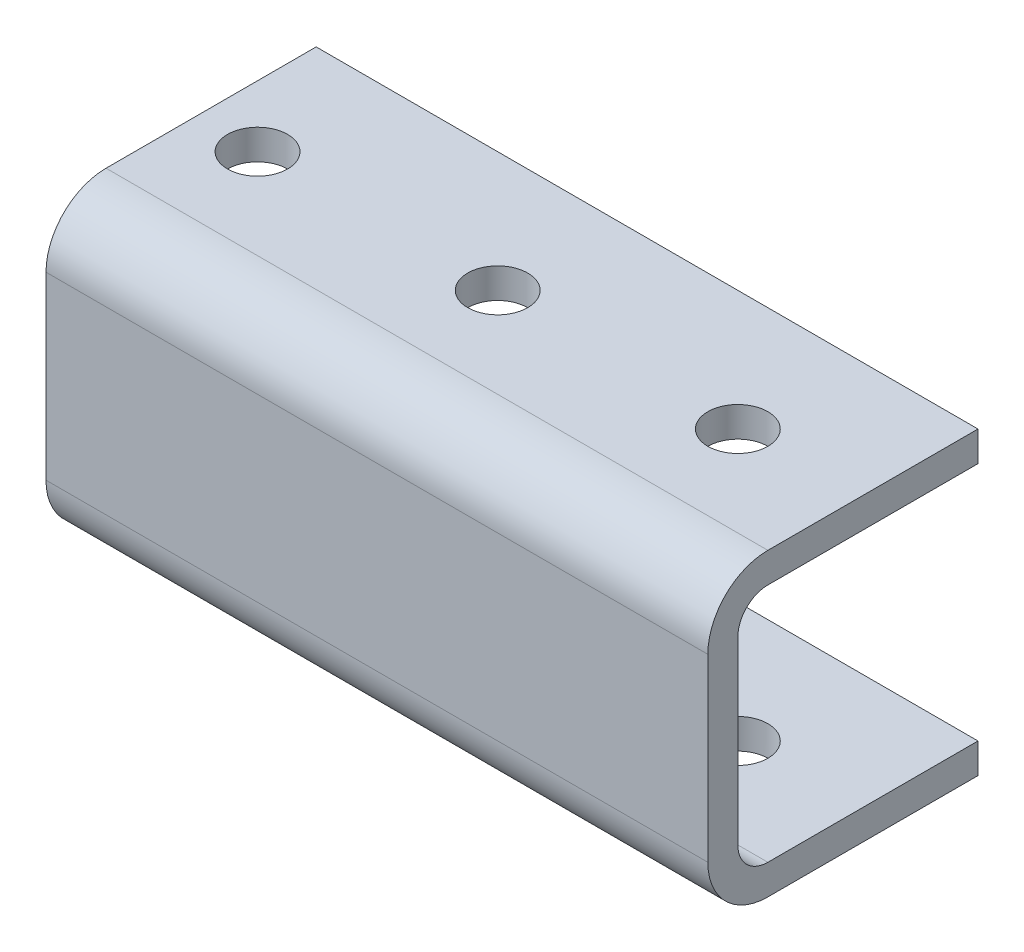
ISO-10303-21;
HEADER;
FILE_DESCRIPTION(('STEP AP214'),'2;1');
FILE_NAME('part.step','',(''),(''),'','','');
FILE_SCHEMA(('AUTOMOTIVE_DESIGN { 1 0 10303 214 1 1 1 1 }'));
ENDSEC;
DATA;
#1=APPLICATION_CONTEXT('core data for automotive mechanical design processes');
#2=APPLICATION_PROTOCOL_DEFINITION('international standard','automotive_design',2000,#1);
#3=PRODUCT_CONTEXT('',#1,'mechanical');
#4=PRODUCT('Part','Part','',(#3));
#5=PRODUCT_RELATED_PRODUCT_CATEGORY('part','',(#4));
#6=PRODUCT_DEFINITION_FORMATION('','',#4);
#7=PRODUCT_DEFINITION_CONTEXT('part definition',#1,'design');
#8=PRODUCT_DEFINITION('design','',#6,#7);
#9=PRODUCT_DEFINITION_SHAPE('','',#8);
#10=(LENGTH_UNIT() NAMED_UNIT(*) SI_UNIT(.MILLI.,.METRE.));
#11=(NAMED_UNIT(*) PLANE_ANGLE_UNIT() SI_UNIT($,.RADIAN.));
#12=(NAMED_UNIT(*) SI_UNIT($,.STERADIAN.) SOLID_ANGLE_UNIT());
#13=UNCERTAINTY_MEASURE_WITH_UNIT(LENGTH_MEASURE(1.E-05),#10,'distance_accuracy_value','');
#14=(GEOMETRIC_REPRESENTATION_CONTEXT(3) GLOBAL_UNCERTAINTY_ASSIGNED_CONTEXT((#13)) GLOBAL_UNIT_ASSIGNED_CONTEXT((#10,
#11,#12)) REPRESENTATION_CONTEXT('',''));
#15=CARTESIAN_POINT('',(0.,0.,0.));
#16=DIRECTION('',(0.,0.,1.));
#17=DIRECTION('',(1.,0.,0.));
#18=AXIS2_PLACEMENT_3D('',#15,#16,#17);
#19=CARTESIAN_POINT('',(872.981011996506,-4.02704283352276,-25.4));
#20=DIRECTION('',(0.,-1.,0.));
#21=DIRECTION('',(0.,0.,-1.));
#22=AXIS2_PLACEMENT_3D('',#19,#20,#21);
#23=PLANE('',#22);
#24=CARTESIAN_POINT('',(860.280011996506,-4.02704283352274,-12.7000000000001));
#25=DIRECTION('',(0.,1.,0.));
#26=DIRECTION('',(0.,0.,1.));
#27=AXIS2_PLACEMENT_3D('',#24,#25,#26);
#28=CIRCLE('',#27,3.17500000000001);
#29=CARTESIAN_POINT('',(860.280011996506,-4.02704283352273,-9.52500000000011));
#30=VERTEX_POINT('',#29);
#31=EDGE_CURVE('E187',#30,#30,#28,.T.);
#32=ORIENTED_EDGE('',*,*,#31,.F.);
#33=EDGE_LOOP('',(#32));
#34=FACE_BOUND('',#33,.T.);
#35=CARTESIAN_POINT('',(834.880011996506,-4.02704283352274,-12.7000000000001));
#36=DIRECTION('',(0.,1.,0.));
#37=DIRECTION('',(0.,0.,1.));
#38=AXIS2_PLACEMENT_3D('',#35,#36,#37);
#39=CIRCLE('',#38,3.17500000000001);
#40=CARTESIAN_POINT('',(834.880011996506,-4.02704283352273,-9.52500000000011));
#41=VERTEX_POINT('',#40);
#42=EDGE_CURVE('E181',#41,#41,#39,.T.);
#43=ORIENTED_EDGE('',*,*,#42,.F.);
#44=EDGE_LOOP('',(#43));
#45=FACE_BOUND('',#44,.T.);
#46=CARTESIAN_POINT('',(809.480011996506,-4.02704283352274,-12.7000000000001));
#47=DIRECTION('',(0.,1.,0.));
#48=DIRECTION('',(0.,0.,1.));
#49=AXIS2_PLACEMENT_3D('',#46,#47,#48);
#50=CIRCLE('',#49,3.17500000000001);
#51=CARTESIAN_POINT('',(809.480011996506,-4.02704283352273,-9.5250000000001));
#52=VERTEX_POINT('',#51);
#53=EDGE_CURVE('E175',#52,#52,#50,.T.);
#54=ORIENTED_EDGE('',*,*,#53,.F.);
#55=EDGE_LOOP('',(#54));
#56=FACE_BOUND('',#55,.T.);
#57=DIRECTION('',(-1.,0.,0.));
#58=VECTOR('',#57,1.);
#59=CARTESIAN_POINT('',(872.981011996506,-4.02704283352276,-25.4));
#60=LINE('',#59,#58);
#61=CARTESIAN_POINT('',(872.980011996506,-4.02704283352276,-25.4));
#62=VERTEX_POINT('',#61);
#63=CARTESIAN_POINT('',(802.980011996506,-4.02704283352282,-25.4));
#64=VERTEX_POINT('',#63);
#65=EDGE_CURVE('E155',#62,#64,#60,.T.);
#66=ORIENTED_EDGE('',*,*,#65,.T.);
#67=DIRECTION('',(0.,0.,1.));
#68=VECTOR('',#67,1.);
#69=CARTESIAN_POINT('',(802.980011996506,-4.02704283352276,-25.4));
#70=LINE('',#69,#68);
#71=CARTESIAN_POINT('',(802.980011996506,-4.02704283352272,-3.175));
#72=VERTEX_POINT('',#71);
#73=EDGE_CURVE('E307',#64,#72,#70,.T.);
#74=ORIENTED_EDGE('',*,*,#73,.T.);
#75=DIRECTION('',(-1.,0.,0.));
#76=VECTOR('',#75,1.);
#77=CARTESIAN_POINT('',(872.980011996506,-4.02704283352272,-3.17499999999999));
#78=LINE('',#77,#76);
#79=CARTESIAN_POINT('',(872.980011996506,-4.02704283352272,-3.17499999999999));
#80=VERTEX_POINT('',#79);
#81=EDGE_CURVE('E203',#72,#80,#78,.F.);
#82=ORIENTED_EDGE('',*,*,#81,.T.);
#83=DIRECTION('',(0.,0.,1.));
#84=VECTOR('',#83,1.);
#85=CARTESIAN_POINT('',(872.980011996506,-4.02704283352276,-25.4));
#86=LINE('',#85,#84);
#87=EDGE_CURVE('E305',#62,#80,#86,.T.);
#88=ORIENTED_EDGE('',*,*,#87,.F.);
#89=EDGE_LOOP('',(#66,#74,#82,#88));
#90=FACE_BOUND('',#89,.T.);
#91=ADVANCED_FACE('F34',(#34,#45,#56,#90),#23,.F.);
#92=CARTESIAN_POINT('',(872.980011996506,-7.20204283352271,-25.4));
#93=DIRECTION('',(0.,0.,1.));
#94=DIRECTION('',(1.,0.,0.));
#95=AXIS2_PLACEMENT_3D('',#92,#93,#94);
#96=PLANE('',#95);
#97=DIRECTION('',(-1.,0.,0.));
#98=VECTOR('',#97,1.);
#99=CARTESIAN_POINT('',(872.981011996506,21.3729571664772,-25.4));
#100=LINE('',#99,#98);
#101=CARTESIAN_POINT('',(872.980011996506,21.3729571664772,-25.4));
#102=VERTEX_POINT('',#101);
#103=CARTESIAN_POINT('',(802.980011996506,21.3729571664772,-25.4));
#104=VERTEX_POINT('',#103);
#105=EDGE_CURVE('E135',#102,#104,#100,.T.);
#106=ORIENTED_EDGE('',*,*,#105,.T.);
#107=DIRECTION('',(0.,1.,0.));
#108=VECTOR('',#107,1.);
#109=CARTESIAN_POINT('',(802.980011996506,-161.452042833523,-25.4));
#110=LINE('',#109,#108);
#111=CARTESIAN_POINT('',(802.980011996506,24.5479571664772,-25.4));
#112=VERTEX_POINT('',#111);
#113=EDGE_CURVE('E124',#104,#112,#110,.T.);
#114=ORIENTED_EDGE('',*,*,#113,.T.);
#115=DIRECTION('',(-1.,0.,0.));
#116=VECTOR('',#115,1.);
#117=CARTESIAN_POINT('',(872.980011996506,24.5479571664772,-25.4));
#118=LINE('',#117,#116);
#119=CARTESIAN_POINT('',(872.980011996506,24.5479571664772,-25.4));
#120=VERTEX_POINT('',#119);
#121=EDGE_CURVE('E133',#120,#112,#118,.T.);
#122=ORIENTED_EDGE('',*,*,#121,.F.);
#123=DIRECTION('',(0.,1.,0.));
#124=VECTOR('',#123,1.);
#125=CARTESIAN_POINT('',(872.980011996506,-7.20204283352271,-25.4));
#126=LINE('',#125,#124);
#127=EDGE_CURVE('E147',#102,#120,#126,.T.);
#128=ORIENTED_EDGE('',*,*,#127,.F.);
#129=EDGE_LOOP('',(#106,#114,#122,#128));
#130=FACE_BOUND('',#129,.T.);
#131=ADVANCED_FACE('F131',(#130),#96,.F.);
#132=CARTESIAN_POINT('',(-16.0199880034941,-7.20204283352271,-25.4));
#133=DIRECTION('',(0.,-1.,0.));
#134=DIRECTION('',(0.,0.,-1.));
#135=AXIS2_PLACEMENT_3D('',#132,#133,#134);
#136=PLANE('',#135);
#137=DIRECTION('',(0.,0.,1.));
#138=VECTOR('',#137,1.);
#139=CARTESIAN_POINT('',(802.980011996506,-7.20204283352271,-25.4));
#140=LINE('',#139,#138);
#141=CARTESIAN_POINT('',(802.980011996506,-7.20204283352283,-25.4));
#142=VERTEX_POINT('',#141);
#143=CARTESIAN_POINT('',(802.980011996506,-7.20204283352271,-3.175));
#144=VERTEX_POINT('',#143);
#145=EDGE_CURVE('E337',#142,#144,#140,.T.);
#146=ORIENTED_EDGE('',*,*,#145,.F.);
#147=DIRECTION('',(1.,0.,0.));
#148=VECTOR('',#147,1.);
#149=CARTESIAN_POINT('',(-16.0199880034941,-7.20204283352271,-25.4));
#150=LINE('',#149,#148);
#151=CARTESIAN_POINT('',(872.980011996506,-7.20204283352271,-25.4));
#152=VERTEX_POINT('',#151);
#153=EDGE_CURVE('E154',#142,#152,#150,.T.);
#154=ORIENTED_EDGE('',*,*,#153,.T.);
#155=DIRECTION('',(0.,0.,1.));
#156=VECTOR('',#155,1.);
#157=CARTESIAN_POINT('',(872.980011996506,-7.20204283352271,-25.4));
#158=LINE('',#157,#156);
#159=CARTESIAN_POINT('',(872.980011996506,-7.20204283352271,-3.175));
#160=VERTEX_POINT('',#159);
#161=EDGE_CURVE('E141',#152,#160,#158,.T.);
#162=ORIENTED_EDGE('',*,*,#161,.T.);
#163=DIRECTION('',(1.,0.,0.));
#164=VECTOR('',#163,1.);
#165=CARTESIAN_POINT('',(-16.0199880034941,-7.20204283352271,-3.175));
#166=LINE('',#165,#164);
#167=EDGE_CURVE('E211',#160,#144,#166,.F.);
#168=ORIENTED_EDGE('',*,*,#167,.T.);
#169=EDGE_LOOP('',(#146,#154,#162,#168));
#170=FACE_BOUND('',#169,.T.);
#171=CARTESIAN_POINT('',(860.280011996506,-7.20204283352271,-12.7000000000001));
#172=DIRECTION('',(0.,-1.,0.));
#173=DIRECTION('',(0.,0.,-1.));
#174=AXIS2_PLACEMENT_3D('',#171,#172,#173);
#175=CIRCLE('',#174,3.17500000000001);
#176=CARTESIAN_POINT('',(860.280011996506,-7.20204283352271,-15.8750000000001));
#177=VERTEX_POINT('',#176);
#178=EDGE_CURVE('E190',#177,#177,#175,.T.);
#179=ORIENTED_EDGE('',*,*,#178,.F.);
#180=EDGE_LOOP('',(#179));
#181=FACE_BOUND('',#180,.T.);
#182=CARTESIAN_POINT('',(834.880011996506,-7.20204283352271,-12.7000000000001));
#183=DIRECTION('',(0.,-1.,0.));
#184=DIRECTION('',(0.,0.,-1.));
#185=AXIS2_PLACEMENT_3D('',#182,#183,#184);
#186=CIRCLE('',#185,3.17500000000001);
#187=CARTESIAN_POINT('',(834.880011996506,-7.20204283352271,-15.8750000000001));
#188=VERTEX_POINT('',#187);
#189=EDGE_CURVE('E184',#188,#188,#186,.T.);
#190=ORIENTED_EDGE('',*,*,#189,.F.);
#191=EDGE_LOOP('',(#190));
#192=FACE_BOUND('',#191,.T.);
#193=CARTESIAN_POINT('',(809.480011996506,-7.20204283352271,-12.7000000000001));
#194=DIRECTION('',(0.,-1.,0.));
#195=DIRECTION('',(0.,0.,-1.));
#196=AXIS2_PLACEMENT_3D('',#193,#194,#195);
#197=CIRCLE('',#196,3.17500000000001);
#198=CARTESIAN_POINT('',(809.480011996506,-7.20204283352271,-15.8750000000001));
#199=VERTEX_POINT('',#198);
#200=EDGE_CURVE('E178',#199,#199,#197,.T.);
#201=ORIENTED_EDGE('',*,*,#200,.F.);
#202=EDGE_LOOP('',(#201));
#203=FACE_BOUND('',#202,.T.);
#204=ADVANCED_FACE('F245',(#170,#181,#192,#203),#136,.T.);
#205=CARTESIAN_POINT('',(872.980011996506,24.5479571664772,-25.4));
#206=DIRECTION('',(0.,1.,0.));
#207=DIRECTION('',(-1.,0.,0.));
#208=AXIS2_PLACEMENT_3D('',#205,#206,#207);
#209=PLANE('',#208);
#210=DIRECTION('',(0.,0.,-1.));
#211=VECTOR('',#210,1.);
#212=CARTESIAN_POINT('',(802.980011996506,24.5479571664772,-25.4));
#213=LINE('',#212,#211);
#214=CARTESIAN_POINT('',(802.980011996506,24.5479571664772,-3.17500000000001));
#215=VERTEX_POINT('',#214);
#216=EDGE_CURVE('E121',#215,#112,#213,.T.);
#217=ORIENTED_EDGE('',*,*,#216,.F.);
#218=DIRECTION('',(-1.,0.,0.));
#219=VECTOR('',#218,1.);
#220=CARTESIAN_POINT('',(872.980011996506,24.5479571664772,-3.175));
#221=LINE('',#220,#219);
#222=CARTESIAN_POINT('',(872.980011996506,24.5479571664772,-3.175));
#223=VERTEX_POINT('',#222);
#224=EDGE_CURVE('E56',#215,#223,#221,.F.);
#225=ORIENTED_EDGE('',*,*,#224,.T.);
#226=DIRECTION('',(0.,0.,1.));
#227=VECTOR('',#226,1.);
#228=CARTESIAN_POINT('',(872.980011996506,24.5479571664772,-25.4));
#229=LINE('',#228,#227);
#230=EDGE_CURVE('E140',#120,#223,#229,.T.);
#231=ORIENTED_EDGE('',*,*,#230,.F.);
#232=ORIENTED_EDGE('',*,*,#121,.T.);
#233=EDGE_LOOP('',(#217,#225,#231,#232));
#234=FACE_BOUND('',#233,.T.);
#235=CARTESIAN_POINT('',(860.280011996506,24.5479571664772,-12.7000000000001));
#236=DIRECTION('',(0.,1.,0.));
#237=DIRECTION('',(0.,0.,1.));
#238=AXIS2_PLACEMENT_3D('',#235,#236,#237);
#239=CIRCLE('',#238,3.17500000000001);
#240=CARTESIAN_POINT('',(860.280011996506,24.5479571664772,-9.52500000000005));
#241=VERTEX_POINT('',#240);
#242=EDGE_CURVE('E172',#241,#241,#239,.T.);
#243=ORIENTED_EDGE('',*,*,#242,.F.);
#244=EDGE_LOOP('',(#243));
#245=FACE_BOUND('',#244,.T.);
#246=CARTESIAN_POINT('',(834.880011996506,24.5479571664772,-12.7000000000001));
#247=DIRECTION('',(0.,1.,0.));
#248=DIRECTION('',(0.,0.,1.));
#249=AXIS2_PLACEMENT_3D('',#246,#247,#248);
#250=CIRCLE('',#249,3.17500000000001);
#251=CARTESIAN_POINT('',(834.880011996506,24.5479571664772,-9.52500000000005));
#252=VERTEX_POINT('',#251);
#253=EDGE_CURVE('E166',#252,#252,#250,.T.);
#254=ORIENTED_EDGE('',*,*,#253,.F.);
#255=EDGE_LOOP('',(#254));
#256=FACE_BOUND('',#255,.T.);
#257=CARTESIAN_POINT('',(809.480011996506,24.5479571664772,-12.7000000000001));
#258=DIRECTION('',(0.,1.,0.));
#259=DIRECTION('',(0.,0.,1.));
#260=AXIS2_PLACEMENT_3D('',#257,#258,#259);
#261=CIRCLE('',#260,3.17500000000001);
#262=CARTESIAN_POINT('',(809.480011996506,24.5479571664772,-9.52500000000004));
#263=VERTEX_POINT('',#262);
#264=EDGE_CURVE('E160',#263,#263,#261,.T.);
#265=ORIENTED_EDGE('',*,*,#264,.F.);
#266=EDGE_LOOP('',(#265));
#267=FACE_BOUND('',#266,.T.);
#268=ADVANCED_FACE('F138',(#234,#245,#256,#267),#209,.T.);
#269=ORIENTED_EDGE('',*,*,#153,.F.);
#270=EDGE_CURVE('E136',#142,#64,#110,.T.);
#271=ORIENTED_EDGE('',*,*,#270,.T.);
#272=ORIENTED_EDGE('',*,*,#65,.F.);
#273=EDGE_CURVE('E142',#152,#62,#126,.T.);
#274=ORIENTED_EDGE('',*,*,#273,.F.);
#275=EDGE_LOOP('',(#269,#271,#272,#274));
#276=FACE_BOUND('',#275,.T.);
#277=ADVANCED_FACE('F247',(#276),#96,.F.);
#278=CARTESIAN_POINT('',(872.980011996506,-7.20204283352271,3.175));
#279=DIRECTION('',(0.,0.,1.));
#280=DIRECTION('',(1.,0.,0.));
#281=AXIS2_PLACEMENT_3D('',#278,#279,#280);
#282=PLANE('',#281);
#283=DIRECTION('',(0.,1.,0.));
#284=VECTOR('',#283,1.);
#285=CARTESIAN_POINT('',(802.980011996506,-7.20204283352271,3.175));
#286=LINE('',#285,#284);
#287=CARTESIAN_POINT('',(802.980011996506,-0.85204283352271,3.175));
#288=VERTEX_POINT('',#287);
#289=CARTESIAN_POINT('',(802.980011996506,18.1979571664772,3.175));
#290=VERTEX_POINT('',#289);
#291=EDGE_CURVE('E48',#288,#290,#286,.T.);
#292=ORIENTED_EDGE('',*,*,#291,.F.);
#293=DIRECTION('',(1.,0.,0.));
#294=VECTOR('',#293,1.);
#295=CARTESIAN_POINT('',(872.980011996506,-0.852042833522709,3.175));
#296=LINE('',#295,#294);
#297=CARTESIAN_POINT('',(872.980011996506,-0.852042833522709,3.175));
#298=VERTEX_POINT('',#297);
#299=EDGE_CURVE('E207',#288,#298,#296,.T.);
#300=ORIENTED_EDGE('',*,*,#299,.T.);
#301=DIRECTION('',(0.,1.,0.));
#302=VECTOR('',#301,1.);
#303=CARTESIAN_POINT('',(872.980011996506,-7.20204283352271,3.175));
#304=LINE('',#303,#302);
#305=CARTESIAN_POINT('',(872.980011996506,18.1979571664772,3.175));
#306=VERTEX_POINT('',#305);
#307=EDGE_CURVE('E151',#298,#306,#304,.T.);
#308=ORIENTED_EDGE('',*,*,#307,.T.);
#309=DIRECTION('',(-1.,0.,0.));
#310=VECTOR('',#309,1.);
#311=CARTESIAN_POINT('',(872.980011996506,18.1979571664772,3.175));
#312=LINE('',#311,#310);
#313=EDGE_CURVE('E214',#306,#290,#312,.T.);
#314=ORIENTED_EDGE('',*,*,#313,.T.);
#315=EDGE_LOOP('',(#292,#300,#308,#314));
#316=FACE_BOUND('',#315,.T.);
#317=ADVANCED_FACE('F224',(#316),#282,.T.);
#318=CARTESIAN_POINT('',(872.981011996506,21.3729571664772,0.));
#319=DIRECTION('',(0.,1.,0.));
#320=DIRECTION('',(0.,0.,1.));
#321=AXIS2_PLACEMENT_3D('',#318,#319,#320);
#322=PLANE('',#321);
#323=CARTESIAN_POINT('',(860.280011996506,21.3729571664772,-12.7000000000001));
#324=DIRECTION('',(0.,1.,0.));
#325=DIRECTION('',(0.,0.,1.));
#326=AXIS2_PLACEMENT_3D('',#323,#324,#325);
#327=CIRCLE('',#326,3.17500000000001);
#328=CARTESIAN_POINT('',(860.280011996506,21.3729571664772,-9.52500000000005));
#329=VERTEX_POINT('',#328);
#330=EDGE_CURVE('E169',#329,#329,#327,.T.);
#331=ORIENTED_EDGE('',*,*,#330,.T.);
#332=EDGE_LOOP('',(#331));
#333=FACE_BOUND('',#332,.T.);
#334=CARTESIAN_POINT('',(834.880011996506,21.3729571664772,-12.7000000000001));
#335=DIRECTION('',(0.,1.,0.));
#336=DIRECTION('',(0.,0.,1.));
#337=AXIS2_PLACEMENT_3D('',#334,#335,#336);
#338=CIRCLE('',#337,3.17500000000001);
#339=CARTESIAN_POINT('',(834.880011996506,21.3729571664772,-9.52500000000005));
#340=VERTEX_POINT('',#339);
#341=EDGE_CURVE('E163',#340,#340,#338,.T.);
#342=ORIENTED_EDGE('',*,*,#341,.T.);
#343=EDGE_LOOP('',(#342));
#344=FACE_BOUND('',#343,.T.);
#345=CARTESIAN_POINT('',(809.480011996506,21.3729571664772,-12.7000000000001));
#346=DIRECTION('',(0.,1.,0.));
#347=DIRECTION('',(0.,0.,1.));
#348=AXIS2_PLACEMENT_3D('',#345,#346,#347);
#349=CIRCLE('',#348,3.17500000000001);
#350=CARTESIAN_POINT('',(809.480011996506,21.3729571664772,-9.52500000000004));
#351=VERTEX_POINT('',#350);
#352=EDGE_CURVE('E156',#351,#351,#349,.T.);
#353=ORIENTED_EDGE('',*,*,#352,.T.);
#354=EDGE_LOOP('',(#353));
#355=FACE_BOUND('',#354,.T.);
#356=DIRECTION('',(-1.,0.,0.));
#357=VECTOR('',#356,1.);
#358=CARTESIAN_POINT('',(-16.0199880034941,21.3729571664772,-3.175));
#359=LINE('',#358,#357);
#360=CARTESIAN_POINT('',(872.980011996506,21.3729571664772,-3.175));
#361=VERTEX_POINT('',#360);
#362=CARTESIAN_POINT('',(802.980011996506,21.3729571664772,-3.175));
#363=VERTEX_POINT('',#362);
#364=EDGE_CURVE('E193',#361,#363,#359,.T.);
#365=ORIENTED_EDGE('',*,*,#364,.T.);
#366=DIRECTION('',(0.,0.,-1.));
#367=VECTOR('',#366,1.);
#368=CARTESIAN_POINT('',(802.980011996506,21.3729571664772,0.));
#369=LINE('',#368,#367);
#370=EDGE_CURVE('E313',#363,#104,#369,.T.);
#371=ORIENTED_EDGE('',*,*,#370,.T.);
#372=ORIENTED_EDGE('',*,*,#105,.F.);
#373=DIRECTION('',(0.,0.,-1.));
#374=VECTOR('',#373,1.);
#375=CARTESIAN_POINT('',(872.980011996506,21.3729571664772,0.));
#376=LINE('',#375,#374);
#377=EDGE_CURVE('E315',#361,#102,#376,.T.);
#378=ORIENTED_EDGE('',*,*,#377,.F.);
#379=EDGE_LOOP('',(#365,#371,#372,#378));
#380=FACE_BOUND('',#379,.T.);
#381=ADVANCED_FACE('F254',(#333,#344,#355,#380),#322,.F.);
#382=CARTESIAN_POINT('',(872.981011996506,-4.02704283352271,0.));
#383=DIRECTION('',(0.,0.,1.));
#384=DIRECTION('',(1.,0.,0.));
#385=AXIS2_PLACEMENT_3D('',#382,#383,#384);
#386=PLANE('',#385);
#387=DIRECTION('',(-1.,0.,0.));
#388=VECTOR('',#387,1.);
#389=CARTESIAN_POINT('',(-16.0199880034941,-0.852042833522716,0.));
#390=LINE('',#389,#388);
#391=CARTESIAN_POINT('',(872.980011996506,-0.852042833522716,0.));
#392=VERTEX_POINT('',#391);
#393=CARTESIAN_POINT('',(802.980011996506,-0.852042833522716,0.));
#394=VERTEX_POINT('',#393);
#395=EDGE_CURVE('E200',#392,#394,#390,.T.);
#396=ORIENTED_EDGE('',*,*,#395,.T.);
#397=DIRECTION('',(0.,1.,0.));
#398=VECTOR('',#397,1.);
#399=CARTESIAN_POINT('',(802.980011996506,-4.02704283352271,0.));
#400=LINE('',#399,#398);
#401=CARTESIAN_POINT('',(802.980011996506,18.1979571664772,0.));
#402=VERTEX_POINT('',#401);
#403=EDGE_CURVE('E332',#394,#402,#400,.T.);
#404=ORIENTED_EDGE('',*,*,#403,.T.);
#405=DIRECTION('',(-1.,0.,0.));
#406=VECTOR('',#405,1.);
#407=CARTESIAN_POINT('',(872.980011996506,18.1979571664772,0.));
#408=LINE('',#407,#406);
#409=CARTESIAN_POINT('',(872.980011996506,18.1979571664772,0.));
#410=VERTEX_POINT('',#409);
#411=EDGE_CURVE('E196',#402,#410,#408,.F.);
#412=ORIENTED_EDGE('',*,*,#411,.T.);
#413=DIRECTION('',(0.,1.,0.));
#414=VECTOR('',#413,1.);
#415=CARTESIAN_POINT('',(872.980011996506,-4.02704283352271,0.));
#416=LINE('',#415,#414);
#417=EDGE_CURVE('E312',#392,#410,#416,.T.);
#418=ORIENTED_EDGE('',*,*,#417,.F.);
#419=EDGE_LOOP('',(#396,#404,#412,#418));
#420=FACE_BOUND('',#419,.T.);
#421=ADVANCED_FACE('F252',(#420),#386,.F.);
#422=CARTESIAN_POINT('',(872.981011996506,18.1979571664772,-3.175));
#423=DIRECTION('',(1.,0.,0.));
#424=DIRECTION('',(0.,0.,-1.));
#425=AXIS2_PLACEMENT_3D('',#422,#423,#424);
#426=CYLINDRICAL_SURFACE('',#425,3.175);
#427=ORIENTED_EDGE('',*,*,#411,.F.);
#428=CARTESIAN_POINT('',(802.980011996506,18.1979571664772,-3.175));
#429=DIRECTION('',(1.,0.,0.));
#430=DIRECTION('',(0.,1.,0.));
#431=AXIS2_PLACEMENT_3D('',#428,#429,#430);
#432=CIRCLE('',#431,3.175);
#433=EDGE_CURVE('E317',#402,#363,#432,.F.);
#434=ORIENTED_EDGE('',*,*,#433,.T.);
#435=ORIENTED_EDGE('',*,*,#364,.F.);
#436=CARTESIAN_POINT('',(872.980011996506,18.1979571664772,-3.175));
#437=DIRECTION('',(1.,0.,0.));
#438=DIRECTION('',(0.,0.,-1.));
#439=AXIS2_PLACEMENT_3D('',#436,#437,#438);
#440=CIRCLE('',#439,3.175);
#441=EDGE_CURVE('E198',#410,#361,#440,.F.);
#442=ORIENTED_EDGE('',*,*,#441,.F.);
#443=EDGE_LOOP('',(#427,#434,#435,#442));
#444=FACE_BOUND('',#443,.T.);
#445=ADVANCED_FACE('F288',(#444),#426,.F.);
#446=CARTESIAN_POINT('',(872.981011996506,-0.852042833522716,-3.175));
#447=DIRECTION('',(1.,0.,0.));
#448=DIRECTION('',(0.,0.,-1.));
#449=AXIS2_PLACEMENT_3D('',#446,#447,#448);
#450=CYLINDRICAL_SURFACE('',#449,3.175);
#451=ORIENTED_EDGE('',*,*,#81,.F.);
#452=CARTESIAN_POINT('',(802.980011996506,-0.852042833522716,-3.175));
#453=DIRECTION('',(1.,0.,0.));
#454=DIRECTION('',(0.,1.,0.));
#455=AXIS2_PLACEMENT_3D('',#452,#453,#454);
#456=CIRCLE('',#455,3.175);
#457=EDGE_CURVE('E300',#72,#394,#456,.F.);
#458=ORIENTED_EDGE('',*,*,#457,.T.);
#459=ORIENTED_EDGE('',*,*,#395,.F.);
#460=CARTESIAN_POINT('',(872.980011996506,-0.852042833522716,-3.175));
#461=DIRECTION('',(1.,0.,0.));
#462=DIRECTION('',(0.,0.,-1.));
#463=AXIS2_PLACEMENT_3D('',#460,#461,#462);
#464=CIRCLE('',#463,3.175);
#465=EDGE_CURVE('E205',#80,#392,#464,.F.);
#466=ORIENTED_EDGE('',*,*,#465,.F.);
#467=EDGE_LOOP('',(#451,#458,#459,#466));
#468=FACE_BOUND('',#467,.T.);
#469=ADVANCED_FACE('F236',(#468),#450,.F.);
#470=CARTESIAN_POINT('',(872.980011996506,-0.852042833522709,-3.175));
#471=DIRECTION('',(1.,0.,0.));
#472=DIRECTION('',(0.,0.,-1.));
#473=AXIS2_PLACEMENT_3D('',#470,#471,#472);
#474=CYLINDRICAL_SURFACE('',#473,6.35);
#475=CARTESIAN_POINT('',(802.980011996506,-0.852042833522709,-3.175));
#476=DIRECTION('',(1.,0.,0.));
#477=DIRECTION('',(0.,1.,0.));
#478=AXIS2_PLACEMENT_3D('',#475,#476,#477);
#479=CIRCLE('',#478,6.35);
#480=EDGE_CURVE('E339',#144,#288,#479,.F.);
#481=ORIENTED_EDGE('',*,*,#480,.F.);
#482=ORIENTED_EDGE('',*,*,#167,.F.);
#483=CARTESIAN_POINT('',(872.980011996506,-0.852042833522709,-3.175));
#484=DIRECTION('',(1.,0.,0.));
#485=DIRECTION('',(0.,0.,-1.));
#486=AXIS2_PLACEMENT_3D('',#483,#484,#485);
#487=CIRCLE('',#486,6.35);
#488=EDGE_CURVE('E209',#298,#160,#487,.T.);
#489=ORIENTED_EDGE('',*,*,#488,.F.);
#490=ORIENTED_EDGE('',*,*,#299,.F.);
#491=EDGE_LOOP('',(#481,#482,#489,#490));
#492=FACE_BOUND('',#491,.T.);
#493=ADVANCED_FACE('F228',(#492),#474,.T.);
#494=CARTESIAN_POINT('',(872.980011996506,18.1979571664772,-3.175));
#495=DIRECTION('',(-1.,0.,0.));
#496=DIRECTION('',(0.,-1.,0.));
#497=AXIS2_PLACEMENT_3D('',#494,#495,#496);
#498=CYLINDRICAL_SURFACE('',#497,6.35);
#499=CARTESIAN_POINT('',(802.980011996506,18.1979571664772,-3.175));
#500=DIRECTION('',(1.,0.,0.));
#501=DIRECTION('',(0.,1.,0.));
#502=AXIS2_PLACEMENT_3D('',#499,#500,#501);
#503=CIRCLE('',#502,6.35);
#504=EDGE_CURVE('E11',#290,#215,#503,.F.);
#505=ORIENTED_EDGE('',*,*,#504,.F.);
#506=ORIENTED_EDGE('',*,*,#313,.F.);
#507=CARTESIAN_POINT('',(872.980011996506,18.1979571664772,-3.175));
#508=DIRECTION('',(1.,0.,0.));
#509=DIRECTION('',(0.,0.,-1.));
#510=AXIS2_PLACEMENT_3D('',#507,#508,#509);
#511=CIRCLE('',#510,6.35);
#512=EDGE_CURVE('E42',#223,#306,#511,.T.);
#513=ORIENTED_EDGE('',*,*,#512,.F.);
#514=ORIENTED_EDGE('',*,*,#224,.F.);
#515=EDGE_LOOP('',(#505,#506,#513,#514));
#516=FACE_BOUND('',#515,.T.);
#517=ADVANCED_FACE('F36',(#516),#498,.T.);
#518=CARTESIAN_POINT('',(872.980011996506,-7.20204283352271,-25.4));
#519=DIRECTION('',(1.,0.,0.));
#520=DIRECTION('',(0.,0.,-1.));
#521=AXIS2_PLACEMENT_3D('',#518,#519,#520);
#522=PLANE('',#521);
#523=ORIENTED_EDGE('',*,*,#230,.T.);
#524=ORIENTED_EDGE('',*,*,#512,.T.);
#525=ORIENTED_EDGE('',*,*,#307,.F.);
#526=ORIENTED_EDGE('',*,*,#488,.T.);
#527=ORIENTED_EDGE('',*,*,#161,.F.);
#528=ORIENTED_EDGE('',*,*,#273,.T.);
#529=ORIENTED_EDGE('',*,*,#87,.T.);
#530=ORIENTED_EDGE('',*,*,#465,.T.);
#531=ORIENTED_EDGE('',*,*,#417,.T.);
#532=ORIENTED_EDGE('',*,*,#441,.T.);
#533=ORIENTED_EDGE('',*,*,#377,.T.);
#534=ORIENTED_EDGE('',*,*,#127,.T.);
#535=EDGE_LOOP('',(#523,#524,#525,#526,#527,#528,#529,#530,#531,#532,#533,#534));
#536=FACE_BOUND('',#535,.T.);
#537=ADVANCED_FACE('F220',(#536),#522,.T.);
#538=CARTESIAN_POINT('',(809.480011996506,24.5479571664772,-12.7000000000001));
#539=DIRECTION('',(0.,1.,0.));
#540=DIRECTION('',(0.,0.,1.));
#541=AXIS2_PLACEMENT_3D('',#538,#539,#540);
#542=CYLINDRICAL_SURFACE('',#541,3.17500000000001);
#543=ORIENTED_EDGE('',*,*,#352,.F.);
#544=EDGE_LOOP('',(#543));
#545=FACE_BOUND('',#544,.T.);
#546=ORIENTED_EDGE('',*,*,#264,.T.);
#547=EDGE_LOOP('',(#546));
#548=FACE_BOUND('',#547,.T.);
#549=ADVANCED_FACE('F234',(#545,#548),#542,.F.);
#550=CARTESIAN_POINT('',(834.880011996506,24.5479571664772,-12.7000000000001));
#551=DIRECTION('',(0.,1.,0.));
#552=DIRECTION('',(0.,0.,1.));
#553=AXIS2_PLACEMENT_3D('',#550,#551,#552);
#554=CYLINDRICAL_SURFACE('',#553,3.17500000000001);
#555=ORIENTED_EDGE('',*,*,#341,.F.);
#556=EDGE_LOOP('',(#555));
#557=FACE_BOUND('',#556,.T.);
#558=ORIENTED_EDGE('',*,*,#253,.T.);
#559=EDGE_LOOP('',(#558));
#560=FACE_BOUND('',#559,.T.);
#561=ADVANCED_FACE('F267',(#557,#560),#554,.F.);
#562=CARTESIAN_POINT('',(860.280011996506,24.5479571664772,-12.7000000000001));
#563=DIRECTION('',(0.,1.,0.));
#564=DIRECTION('',(0.,0.,1.));
#565=AXIS2_PLACEMENT_3D('',#562,#563,#564);
#566=CYLINDRICAL_SURFACE('',#565,3.17500000000001);
#567=ORIENTED_EDGE('',*,*,#330,.F.);
#568=EDGE_LOOP('',(#567));
#569=FACE_BOUND('',#568,.T.);
#570=ORIENTED_EDGE('',*,*,#242,.T.);
#571=EDGE_LOOP('',(#570));
#572=FACE_BOUND('',#571,.T.);
#573=ADVANCED_FACE('F271',(#569,#572),#566,.F.);
#574=CARTESIAN_POINT('',(809.480011996506,-4.02704283352274,-12.7000000000001));
#575=DIRECTION('',(0.,1.,0.));
#576=DIRECTION('',(0.,0.,1.));
#577=AXIS2_PLACEMENT_3D('',#574,#575,#576);
#578=CYLINDRICAL_SURFACE('',#577,3.17500000000001);
#579=ORIENTED_EDGE('',*,*,#53,.T.);
#580=EDGE_LOOP('',(#579));
#581=FACE_BOUND('',#580,.T.);
#582=ORIENTED_EDGE('',*,*,#200,.T.);
#583=EDGE_LOOP('',(#582));
#584=FACE_BOUND('',#583,.T.);
#585=ADVANCED_FACE('F275',(#581,#584),#578,.F.);
#586=CARTESIAN_POINT('',(834.880011996506,-4.02704283352274,-12.7000000000001));
#587=DIRECTION('',(0.,1.,0.));
#588=DIRECTION('',(0.,0.,1.));
#589=AXIS2_PLACEMENT_3D('',#586,#587,#588);
#590=CYLINDRICAL_SURFACE('',#589,3.17500000000001);
#591=ORIENTED_EDGE('',*,*,#42,.T.);
#592=EDGE_LOOP('',(#591));
#593=FACE_BOUND('',#592,.T.);
#594=ORIENTED_EDGE('',*,*,#189,.T.);
#595=EDGE_LOOP('',(#594));
#596=FACE_BOUND('',#595,.T.);
#597=ADVANCED_FACE('F279',(#593,#596),#590,.F.);
#598=CARTESIAN_POINT('',(860.280011996506,-4.02704283352274,-12.7000000000001));
#599=DIRECTION('',(0.,1.,0.));
#600=DIRECTION('',(0.,0.,1.));
#601=AXIS2_PLACEMENT_3D('',#598,#599,#600);
#602=CYLINDRICAL_SURFACE('',#601,3.17500000000001);
#603=ORIENTED_EDGE('',*,*,#31,.T.);
#604=EDGE_LOOP('',(#603));
#605=FACE_BOUND('',#604,.T.);
#606=ORIENTED_EDGE('',*,*,#178,.T.);
#607=EDGE_LOOP('',(#606));
#608=FACE_BOUND('',#607,.T.);
#609=ADVANCED_FACE('F283',(#605,#608),#602,.F.);
#610=CARTESIAN_POINT('',(802.980011996506,-161.452042833523,-25.4));
#611=DIRECTION('',(1.,0.,0.));
#612=DIRECTION('',(0.,1.,0.));
#613=AXIS2_PLACEMENT_3D('',#610,#611,#612);
#614=PLANE('',#613);
#615=ORIENTED_EDGE('',*,*,#433,.F.);
#616=ORIENTED_EDGE('',*,*,#403,.F.);
#617=ORIENTED_EDGE('',*,*,#457,.F.);
#618=ORIENTED_EDGE('',*,*,#73,.F.);
#619=ORIENTED_EDGE('',*,*,#270,.F.);
#620=ORIENTED_EDGE('',*,*,#145,.T.);
#621=ORIENTED_EDGE('',*,*,#480,.T.);
#622=ORIENTED_EDGE('',*,*,#291,.T.);
#623=ORIENTED_EDGE('',*,*,#504,.T.);
#624=ORIENTED_EDGE('',*,*,#216,.T.);
#625=ORIENTED_EDGE('',*,*,#113,.F.);
#626=ORIENTED_EDGE('',*,*,#370,.F.);
#627=EDGE_LOOP('',(#615,#616,#617,#618,#619,#620,#621,#622,#623,#624,#625,#626));
#628=FACE_BOUND('',#627,.T.);
#629=ADVANCED_FACE('F123',(#628),#614,.F.);
#630=CLOSED_SHELL('',(#91,#131,#204,#268,#277,#317,#381,#421,#445,#469,#493,#517,#537,#549,#561,
#573,#585,#597,#609,#629));
#631=MANIFOLD_SOLID_BREP('B2',#630);
#632=ADVANCED_BREP_SHAPE_REPRESENTATION('',(#18,#631),#14);
#633=SHAPE_DEFINITION_REPRESENTATION(#9,#632);
ENDSEC;
END-ISO-10303-21;
